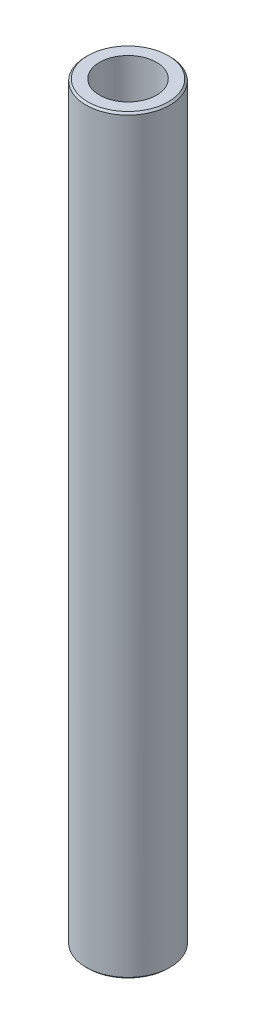
ISO-10303-21;
HEADER;
FILE_DESCRIPTION(('STEP AP214'),'2;1');
FILE_NAME('part.step','',(''),(''),'','','');
FILE_SCHEMA(('AUTOMOTIVE_DESIGN { 1 0 10303 214 1 1 1 1 }'));
ENDSEC;
DATA;
#1=APPLICATION_CONTEXT('core data for automotive mechanical design processes');
#2=APPLICATION_PROTOCOL_DEFINITION('international standard','automotive_design',2000,#1);
#3=PRODUCT_CONTEXT('',#1,'mechanical');
#4=PRODUCT('Part','Part','',(#3));
#5=PRODUCT_RELATED_PRODUCT_CATEGORY('part','',(#4));
#6=PRODUCT_DEFINITION_FORMATION('','',#4);
#7=PRODUCT_DEFINITION_CONTEXT('part definition',#1,'design');
#8=PRODUCT_DEFINITION('design','',#6,#7);
#9=PRODUCT_DEFINITION_SHAPE('','',#8);
#10=(LENGTH_UNIT() NAMED_UNIT(*) SI_UNIT(.MILLI.,.METRE.));
#11=(NAMED_UNIT(*) PLANE_ANGLE_UNIT() SI_UNIT($,.RADIAN.));
#12=(NAMED_UNIT(*) SI_UNIT($,.STERADIAN.) SOLID_ANGLE_UNIT());
#13=UNCERTAINTY_MEASURE_WITH_UNIT(LENGTH_MEASURE(1.E-05),#10,'distance_accuracy_value','');
#14=(GEOMETRIC_REPRESENTATION_CONTEXT(3) GLOBAL_UNCERTAINTY_ASSIGNED_CONTEXT((#13)) GLOBAL_UNIT_ASSIGNED_CONTEXT((#10,
#11,#12)) REPRESENTATION_CONTEXT('',''));
#15=CARTESIAN_POINT('',(0.,0.,0.));
#16=DIRECTION('',(0.,0.,1.));
#17=DIRECTION('',(1.,0.,0.));
#18=AXIS2_PLACEMENT_3D('',#15,#16,#17);
#19=CARTESIAN_POINT('',(0.,223.375860077223,0.));
#20=DIRECTION('',(0.,-1.,0.));
#21=DIRECTION('',(0.,0.,-1.));
#22=AXIS2_PLACEMENT_3D('',#19,#20,#21);
#23=CYLINDRICAL_SURFACE('',#22,12.5);
#24=CARTESIAN_POINT('',(0.,222.829628221928,0.));
#25=DIRECTION('',(0.,1.,0.));
#26=DIRECTION('',(0.,0.,1.));
#27=AXIS2_PLACEMENT_3D('',#24,#25,#26);
#28=CIRCLE('',#27,12.5);
#29=CARTESIAN_POINT('',(0.,222.829628221928,-12.5));
#30=VERTEX_POINT('',#29);
#31=EDGE_CURVE('E50',#30,#30,#28,.F.);
#32=CARTESIAN_POINT('',(0.,0.546231855294954,0.));
#33=DIRECTION('',(0.,1.,0.));
#34=DIRECTION('',(0.,0.,1.));
#35=AXIS2_PLACEMENT_3D('',#32,#33,#34);
#36=CIRCLE('',#35,12.5);
#37=CARTESIAN_POINT('',(0.,0.546231855294954,-12.5));
#38=VERTEX_POINT('',#37);
#39=EDGE_CURVE('E51',#38,#38,#36,.T.);
#40=CARTESIAN_POINT('',(0.,222.829628221928,-12.5));
#41=CARTESIAN_POINT('',(0.,220.514176176442,-12.5));
#42=CARTESIAN_POINT('',(0.,218.198724130957,-12.5));
#43=CARTESIAN_POINT('',(0.,213.567820039985,-12.5));
#44=CARTESIAN_POINT('',(0.,211.252367994499,-12.5));
#45=CARTESIAN_POINT('',(0.,206.621463903528,-12.5));
#46=CARTESIAN_POINT('',(0.,204.306011858042,-12.5));
#47=CARTESIAN_POINT('',(0.,199.67510776707,-12.5));
#48=CARTESIAN_POINT('',(0.,197.359655721585,-12.5));
#49=CARTESIAN_POINT('',(0.,192.728751630613,-12.5));
#50=CARTESIAN_POINT('',(0.,190.413299585127,-12.5));
#51=CARTESIAN_POINT('',(0.,185.782395494156,-12.5));
#52=CARTESIAN_POINT('',(0.,183.46694344867,-12.5));
#53=CARTESIAN_POINT('',(0.,178.836039357699,-12.5));
#54=CARTESIAN_POINT('',(0.,176.520587312213,-12.5));
#55=CARTESIAN_POINT('',(0.,171.889683221241,-12.5));
#56=CARTESIAN_POINT('',(0.,169.574231175756,-12.5));
#57=CARTESIAN_POINT('',(0.,164.943327084784,-12.5));
#58=CARTESIAN_POINT('',(0.,162.627875039298,-12.5));
#59=CARTESIAN_POINT('',(0.,157.996970948327,-12.5));
#60=CARTESIAN_POINT('',(0.,155.681518902841,-12.5));
#61=CARTESIAN_POINT('',(0.,151.050614811869,-12.5));
#62=CARTESIAN_POINT('',(0.,148.735162766384,-12.5));
#63=CARTESIAN_POINT('',(0.,144.104258675412,-12.5));
#64=CARTESIAN_POINT('',(0.,141.788806629926,-12.5));
#65=CARTESIAN_POINT('',(0.,137.157902538955,-12.5));
#66=CARTESIAN_POINT('',(0.,134.842450493469,-12.5));
#67=CARTESIAN_POINT('',(0.,130.211546402498,-12.5));
#68=CARTESIAN_POINT('',(0.,127.896094357012,-12.5));
#69=CARTESIAN_POINT('',(0.,123.26519026604,-12.5));
#70=CARTESIAN_POINT('',(0.,120.949738220555,-12.5));
#71=CARTESIAN_POINT('',(0.,116.318834129583,-12.5));
#72=CARTESIAN_POINT('',(0.,114.003382084097,-12.5));
#73=CARTESIAN_POINT('',(0.,109.372477993126,-12.5));
#74=CARTESIAN_POINT('',(0.,107.05702594764,-12.5));
#75=CARTESIAN_POINT('',(0.,102.426121856668,-12.5));
#76=CARTESIAN_POINT('',(0.,100.110669811183,-12.5));
#77=CARTESIAN_POINT('',(0.,95.4797657202112,-12.5));
#78=CARTESIAN_POINT('',(0.,93.1643136747254,-12.5));
#79=CARTESIAN_POINT('',(0.,88.5334095837539,-12.5));
#80=CARTESIAN_POINT('',(0.,86.2179575382682,-12.5));
#81=CARTESIAN_POINT('',(0.,81.5870534472966,-12.5));
#82=CARTESIAN_POINT('',(0.,79.2716014018108,-12.5));
#83=CARTESIAN_POINT('',(0.,74.6406973108393,-12.5));
#84=CARTESIAN_POINT('',(0.,72.3252452653535,-12.5));
#85=CARTESIAN_POINT('',(0.,67.694341174382,-12.5));
#86=CARTESIAN_POINT('',(0.,65.3788891288963,-12.5));
#87=CARTESIAN_POINT('',(0.,60.7479850379247,-12.5));
#88=CARTESIAN_POINT('',(0.,58.432532992439,-12.5));
#89=CARTESIAN_POINT('',(0.,53.8016289014675,-12.5));
#90=CARTESIAN_POINT('',(0.,51.4861768559817,-12.5));
#91=CARTESIAN_POINT('',(0.,46.8552727650102,-12.5));
#92=CARTESIAN_POINT('',(0.,44.5398207195244,-12.5));
#93=CARTESIAN_POINT('',(0.,39.9089166285529,-12.5));
#94=CARTESIAN_POINT('',(0.,37.5934645830672,-12.5));
#95=CARTESIAN_POINT('',(0.,32.9625604920956,-12.5));
#96=CARTESIAN_POINT('',(0.,30.6471084466098,-12.5));
#97=CARTESIAN_POINT('',(0.,26.0162043556383,-12.5));
#98=CARTESIAN_POINT('',(0.,23.7007523101525,-12.5));
#99=CARTESIAN_POINT('',(0.,19.069848219181,-12.5));
#100=CARTESIAN_POINT('',(0.,16.7543961736953,-12.5));
#101=CARTESIAN_POINT('',(0.,12.1234920827237,-12.5));
#102=CARTESIAN_POINT('',(0.,9.80804003723799,-12.5));
#103=CARTESIAN_POINT('',(0.,5.17713594626647,-12.5));
#104=CARTESIAN_POINT('',(0.,2.86168390078072,-12.5));
#105=CARTESIAN_POINT('',(0.,0.546231855294954,-12.5));
#106=B_SPLINE_CURVE_WITH_KNOTS('',3,(#40,#41,#42,#43,#44,#45,#46,#47,#48,#49,#50,#51,#52,#53,
#54,#55,#56,#57,#58,#59,#60,#61,#62,#63,#64,#65,#66,#67,#68,#69,#70,#71,#72,#73,#74,#75,#76,#77,
#78,#79,#80,#81,#82,#83,#84,#85,#86,#87,#88,#89,#90,#91,#92,#93,#94,#95,#96,#97,#98,#99,#100,
#101,#102,#103,#104,#105),.UNSPECIFIED.,.F.,.F.,(4,2,2,2,2,2,2,2,2,2,2,2,2,2,2,2,2,2,2,2,2,2,2,
2,2,2,2,2,2,2,2,2,4),(0.,6.9463561364573,13.8927122729146,20.8390684093719,27.7854245458292,
34.7317806822864,41.6781368187437,48.624492955201,55.5708490916583,62.5172052281156,
69.4635613645729,76.4099175010301,83.3562736374874,90.3026297739447,97.248985910402,
104.195342046859,111.141698183317,118.088054319774,125.034410456231,131.980766592688,
138.927122729146,145.873478865603,152.81983500206,159.766191138518,166.712547274975,
173.658903411432,180.605259547889,187.551615684347,194.497971820804,201.444327957261,
208.390684093719,215.337040230176,222.283396366633),.UNSPECIFIED.);
#107=EDGE_CURVE('BSEAM39',#30,#38,#106,.T.);
#108=ORIENTED_EDGE('',*,*,#31,.T.);
#109=ORIENTED_EDGE('',*,*,#39,.T.);
#110=ORIENTED_EDGE('',*,*,#107,.T.);
#111=ORIENTED_EDGE('',*,*,#107,.F.);
#112=EDGE_LOOP('',(#108,#110,#109,#111));
#113=FACE_BOUND('',#112,.T.);
#114=ADVANCED_FACE('F39',(#113),#23,.T.);
#115=CARTESIAN_POINT('',(0.,223.375860077223,0.));
#116=DIRECTION('',(0.,1.,0.));
#117=DIRECTION('',(0.,0.,1.));
#118=AXIS2_PLACEMENT_3D('',#115,#116,#117);
#119=PLANE('',#118);
#120=CARTESIAN_POINT('',(0.,223.375860077223,0.));
#121=DIRECTION('',(0.,1.,0.));
#122=DIRECTION('',(0.,0.,1.));
#123=AXIS2_PLACEMENT_3D('',#120,#121,#122);
#124=CIRCLE('',#123,11.9537681447053);
#125=CARTESIAN_POINT('',(0.,223.375860077223,11.9537681447053));
#126=VERTEX_POINT('',#125);
#127=EDGE_CURVE('E54',#126,#126,#124,.T.);
#128=ORIENTED_EDGE('',*,*,#127,.T.);
#129=EDGE_LOOP('',(#128));
#130=FACE_BOUND('',#129,.T.);
#131=CARTESIAN_POINT('',(0.,223.375860077223,0.));
#132=DIRECTION('',(0.,1.,0.));
#133=DIRECTION('',(0.,0.,1.));
#134=AXIS2_PLACEMENT_3D('',#131,#132,#133);
#135=CIRCLE('',#134,8.47878161098445);
#136=CARTESIAN_POINT('',(0.,223.375860077223,-8.47878161098445));
#137=VERTEX_POINT('',#136);
#138=EDGE_CURVE('E58',#137,#137,#135,.T.);
#139=ORIENTED_EDGE('',*,*,#138,.F.);
#140=EDGE_LOOP('',(#139));
#141=FACE_BOUND('',#140,.T.);
#142=ADVANCED_FACE('F69',(#130,#141),#119,.T.);
#143=CARTESIAN_POINT('',(0.,0.,0.));
#144=DIRECTION('',(0.,1.,0.));
#145=DIRECTION('',(0.,0.,1.));
#146=AXIS2_PLACEMENT_3D('',#143,#144,#145);
#147=PLANE('',#146);
#148=CARTESIAN_POINT('',(0.,0.,0.));
#149=DIRECTION('',(0.,1.,0.));
#150=DIRECTION('',(0.,0.,1.));
#151=AXIS2_PLACEMENT_3D('',#148,#149,#150);
#152=CIRCLE('',#151,11.9537681447051);
#153=CARTESIAN_POINT('',(0.,0.,11.9537681447051));
#154=VERTEX_POINT('',#153);
#155=EDGE_CURVE('E10',#154,#154,#152,.F.);
#156=ORIENTED_EDGE('',*,*,#155,.T.);
#157=EDGE_LOOP('',(#156));
#158=FACE_BOUND('',#157,.T.);
#159=CARTESIAN_POINT('',(0.,0.,0.));
#160=DIRECTION('',(0.,1.,0.));
#161=DIRECTION('',(0.,0.,1.));
#162=AXIS2_PLACEMENT_3D('',#159,#160,#161);
#163=CIRCLE('',#162,8.47878161098445);
#164=CARTESIAN_POINT('',(0.,0.,-8.47878161098445));
#165=VERTEX_POINT('',#164);
#166=EDGE_CURVE('E63',#165,#165,#163,.T.);
#167=ORIENTED_EDGE('',*,*,#166,.T.);
#168=EDGE_LOOP('',(#167));
#169=FACE_BOUND('',#168,.T.);
#170=ADVANCED_FACE('F75',(#158,#169),#147,.F.);
#171=CARTESIAN_POINT('',(0.,223.375860077223,0.));
#172=DIRECTION('',(0.,-1.,0.));
#173=DIRECTION('',(0.,0.,-1.));
#174=AXIS2_PLACEMENT_3D('',#171,#172,#173);
#175=CYLINDRICAL_SURFACE('',#174,8.47878161098445);
#176=CARTESIAN_POINT('',(0.,223.375860077223,-8.47878161098445));
#177=CARTESIAN_POINT('',(0.,221.049028201418,-8.47878161098445));
#178=CARTESIAN_POINT('',(0.,218.722196325614,-8.47878161098445));
#179=CARTESIAN_POINT('',(0.,214.068532574005,-8.47878161098445));
#180=CARTESIAN_POINT('',(0.,211.741700698201,-8.47878161098445));
#181=CARTESIAN_POINT('',(0.,207.088036946592,-8.47878161098445));
#182=CARTESIAN_POINT('',(0.,204.761205070787,-8.47878161098445));
#183=CARTESIAN_POINT('',(0.,200.107541319179,-8.47878161098445));
#184=CARTESIAN_POINT('',(0.,197.780709443374,-8.47878161098445));
#185=CARTESIAN_POINT('',(0.,193.127045691765,-8.47878161098445));
#186=CARTESIAN_POINT('',(0.,190.800213815961,-8.47878161098445));
#187=CARTESIAN_POINT('',(0.,186.146550064352,-8.47878161098445));
#188=CARTESIAN_POINT('',(0.,183.819718188548,-8.47878161098445));
#189=CARTESIAN_POINT('',(0.,179.166054436939,-8.47878161098445));
#190=CARTESIAN_POINT('',(0.,176.839222561135,-8.47878161098445));
#191=CARTESIAN_POINT('',(0.,172.185558809526,-8.47878161098445));
#192=CARTESIAN_POINT('',(0.,169.858726933721,-8.47878161098445));
#193=CARTESIAN_POINT('',(0.,165.205063182113,-8.47878161098445));
#194=CARTESIAN_POINT('',(0.,162.878231306308,-8.47878161098445));
#195=CARTESIAN_POINT('',(0.,158.224567554699,-8.47878161098445));
#196=CARTESIAN_POINT('',(0.,155.897735678895,-8.47878161098445));
#197=CARTESIAN_POINT('',(0.,151.244071927286,-8.47878161098445));
#198=CARTESIAN_POINT('',(0.,148.917240051482,-8.47878161098445));
#199=CARTESIAN_POINT('',(0.,144.263576299873,-8.47878161098445));
#200=CARTESIAN_POINT('',(0.,141.936744424069,-8.47878161098445));
#201=CARTESIAN_POINT('',(0.,137.28308067246,-8.47878161098445));
#202=CARTESIAN_POINT('',(0.,134.956248796655,-8.47878161098445));
#203=CARTESIAN_POINT('',(0.,130.302585045047,-8.47878161098445));
#204=CARTESIAN_POINT('',(0.,127.975753169242,-8.47878161098445));
#205=CARTESIAN_POINT('',(0.,123.322089417633,-8.47878161098445));
#206=CARTESIAN_POINT('',(0.,120.995257541829,-8.47878161098445));
#207=CARTESIAN_POINT('',(0.,116.34159379022,-8.47878161098445));
#208=CARTESIAN_POINT('',(0.,114.014761914416,-8.47878161098445));
#209=CARTESIAN_POINT('',(0.,109.361098162807,-8.47878161098445));
#210=CARTESIAN_POINT('',(0.,107.034266287003,-8.47878161098445));
#211=CARTESIAN_POINT('',(0.,102.380602535394,-8.47878161098445));
#212=CARTESIAN_POINT('',(0.,100.053770659589,-8.47878161098445));
#213=CARTESIAN_POINT('',(0.,95.4001069079806,-8.47878161098445));
#214=CARTESIAN_POINT('',(0.,93.0732750321762,-8.47878161098445));
#215=CARTESIAN_POINT('',(0.,88.4196112805674,-8.47878161098445));
#216=CARTESIAN_POINT('',(0.,86.092779404763,-8.47878161098445));
#217=CARTESIAN_POINT('',(0.,81.4391156531541,-8.47878161098445));
#218=CARTESIAN_POINT('',(0.,79.1122837773497,-8.47878161098445));
#219=CARTESIAN_POINT('',(0.,74.4586200257409,-8.47878161098445));
#220=CARTESIAN_POINT('',(0.,72.1317881499365,-8.47878161098445));
#221=CARTESIAN_POINT('',(0.,67.4781243983277,-8.47878161098445));
#222=CARTESIAN_POINT('',(0.,65.1512925225233,-8.47878161098445));
#223=CARTESIAN_POINT('',(0.,60.4976287709145,-8.47878161098445));
#224=CARTESIAN_POINT('',(0.,58.1707968951101,-8.47878161098445));
#225=CARTESIAN_POINT('',(0.,53.5171331435013,-8.47878161098445));
#226=CARTESIAN_POINT('',(0.,51.1903012676969,-8.47878161098445));
#227=CARTESIAN_POINT('',(0.,46.5366375160881,-8.47878161098445));
#228=CARTESIAN_POINT('',(0.,44.2098056402837,-8.47878161098445));
#229=CARTESIAN_POINT('',(0.,39.5561418886749,-8.47878161098445));
#230=CARTESIAN_POINT('',(0.,37.2293100128705,-8.47878161098445));
#231=CARTESIAN_POINT('',(0.,32.5756462612617,-8.47878161098445));
#232=CARTESIAN_POINT('',(0.,30.2488143854572,-8.47878161098445));
#233=CARTESIAN_POINT('',(0.,25.5951506338484,-8.47878161098445));
#234=CARTESIAN_POINT('',(0.,23.268318758044,-8.47878161098445));
#235=CARTESIAN_POINT('',(0.,18.6146550064352,-8.47878161098445));
#236=CARTESIAN_POINT('',(0.,16.2878231306308,-8.47878161098445));
#237=CARTESIAN_POINT('',(0.,11.634159379022,-8.47878161098445));
#238=CARTESIAN_POINT('',(0.,9.30732750321761,-8.47878161098445));
#239=CARTESIAN_POINT('',(0.,4.65366375160881,-8.47878161098445));
#240=CARTESIAN_POINT('',(0.,2.3268318758044,-8.47878161098445));
#241=CARTESIAN_POINT('',(0.,0.,-8.47878161098445));
#242=B_SPLINE_CURVE_WITH_KNOTS('',3,(#176,#177,#178,#179,#180,#181,#182,#183,#184,#185,#186,
#187,#188,#189,#190,#191,#192,#193,#194,#195,#196,#197,#198,#199,#200,#201,#202,#203,#204,#205,
#206,#207,#208,#209,#210,#211,#212,#213,#214,#215,#216,#217,#218,#219,#220,#221,#222,#223,#224,
#225,#226,#227,#228,#229,#230,#231,#232,#233,#234,#235,#236,#237,#238,#239,#240,#241),
.UNSPECIFIED.,.F.,.F.,(4,2,2,2,2,2,2,2,2,2,2,2,2,2,2,2,2,2,2,2,2,2,2,2,2,2,2,2,2,2,2,2,4),(0.,
6.98049562741324,13.9609912548264,20.9414868822397,27.9219825096529,34.9024781370661,
41.8829737644793,48.8634693918925,55.8439650193057,62.8244606467189,69.8049562741321,
76.7854519015453,83.7659475289585,90.7464431563717,97.726938783785,104.707434411198,
111.687930038611,118.668425666025,125.648921293438,132.629416920851,139.609912548264,
146.590408175677,153.570903803091,160.551399430504,167.531895057917,174.51239068533,
181.492886312743,188.473381940157,195.45387756757,202.434373194983,209.414868822396,
216.39536444981,223.375860077223),.UNSPECIFIED.);
#243=EDGE_CURVE('BSEAM70',#137,#165,#242,.T.);
#244=ORIENTED_EDGE('',*,*,#138,.T.);
#245=ORIENTED_EDGE('',*,*,#166,.F.);
#246=ORIENTED_EDGE('',*,*,#243,.T.);
#247=ORIENTED_EDGE('',*,*,#243,.F.);
#248=EDGE_LOOP('',(#244,#246,#245,#247));
#249=FACE_BOUND('',#248,.T.);
#250=ADVANCED_FACE('F70',(#249),#175,.F.);
#251=CARTESIAN_POINT('',(0.,223.375860077223,0.));
#252=DIRECTION('',(0.,-1.,0.));
#253=DIRECTION('',(0.,0.,-1.));
#254=AXIS2_PLACEMENT_3D('',#251,#252,#253);
#255=CONICAL_SURFACE('',#254,11.9537681447053,0.78539816339744);
#256=ORIENTED_EDGE('',*,*,#31,.F.);
#257=EDGE_LOOP('',(#256));
#258=FACE_BOUND('',#257,.T.);
#259=ORIENTED_EDGE('',*,*,#127,.F.);
#260=EDGE_LOOP('',(#259));
#261=FACE_BOUND('',#260,.T.);
#262=ADVANCED_FACE('F81',(#258,#261),#255,.T.);
#263=CARTESIAN_POINT('',(0.,0.546231855294954,0.));
#264=DIRECTION('',(0.,1.,0.));
#265=DIRECTION('',(0.,0.,1.));
#266=AXIS2_PLACEMENT_3D('',#263,#264,#265);
#267=CONICAL_SURFACE('',#266,12.5,0.785398163397415);
#268=ORIENTED_EDGE('',*,*,#155,.F.);
#269=EDGE_LOOP('',(#268));
#270=FACE_BOUND('',#269,.T.);
#271=ORIENTED_EDGE('',*,*,#39,.F.);
#272=EDGE_LOOP('',(#271));
#273=FACE_BOUND('',#272,.T.);
#274=ADVANCED_FACE('F45',(#270,#273),#267,.T.);
#275=CLOSED_SHELL('',(#114,#142,#170,#250,#262,#274));
#276=MANIFOLD_SOLID_BREP('B2',#275);
#277=ADVANCED_BREP_SHAPE_REPRESENTATION('',(#18,#276),#14);
#278=SHAPE_DEFINITION_REPRESENTATION(#9,#277);
ENDSEC;
END-ISO-10303-21;
